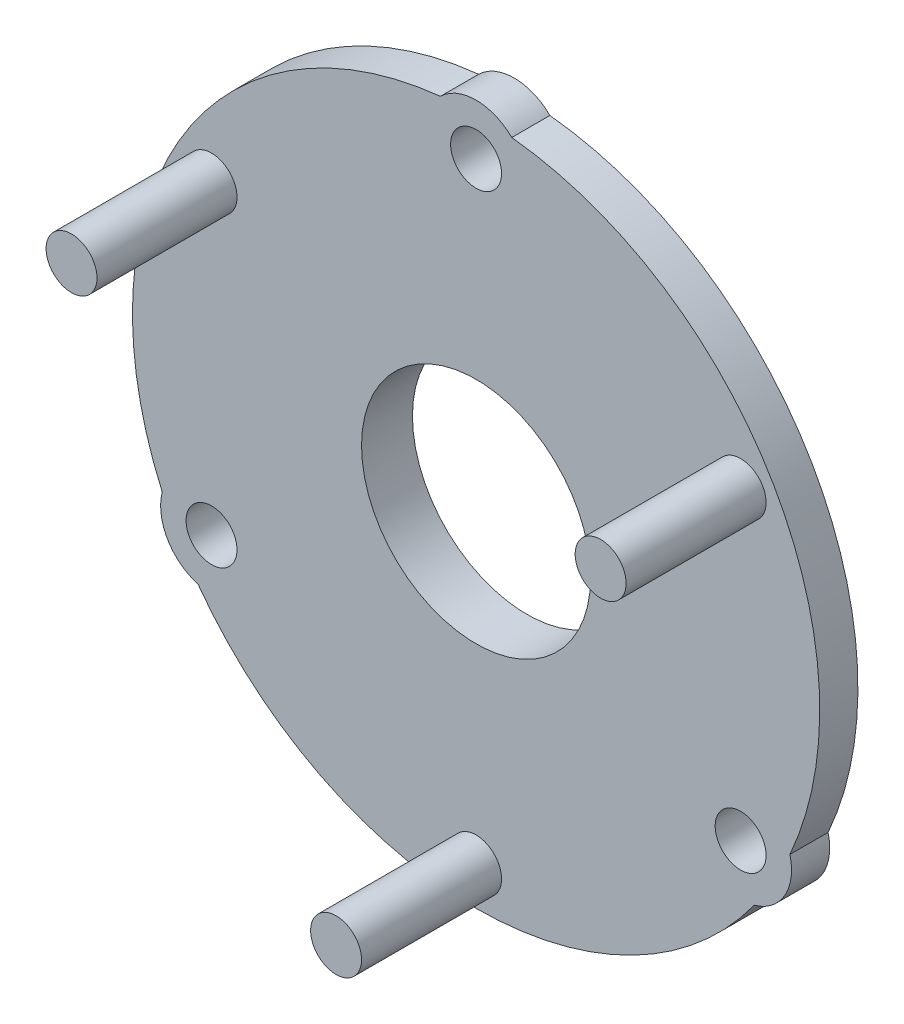
ISO-10303-21;
HEADER;
FILE_DESCRIPTION(('STEP AP214'),'2;1');
FILE_NAME('part.step','',(''),(''),'','','');
FILE_SCHEMA(('AUTOMOTIVE_DESIGN { 1 0 10303 214 1 1 1 1 }'));
ENDSEC;
DATA;
#1=APPLICATION_CONTEXT('core data for automotive mechanical design processes');
#2=APPLICATION_PROTOCOL_DEFINITION('international standard','automotive_design',2000,#1);
#3=PRODUCT_CONTEXT('',#1,'mechanical');
#4=PRODUCT('Part','Part','',(#3));
#5=PRODUCT_RELATED_PRODUCT_CATEGORY('part','',(#4));
#6=PRODUCT_DEFINITION_FORMATION('','',#4);
#7=PRODUCT_DEFINITION_CONTEXT('part definition',#1,'design');
#8=PRODUCT_DEFINITION('design','',#6,#7);
#9=PRODUCT_DEFINITION_SHAPE('','',#8);
#10=(LENGTH_UNIT() NAMED_UNIT(*) SI_UNIT(.MILLI.,.METRE.));
#11=(NAMED_UNIT(*) PLANE_ANGLE_UNIT() SI_UNIT($,.RADIAN.));
#12=(NAMED_UNIT(*) SI_UNIT($,.STERADIAN.) SOLID_ANGLE_UNIT());
#13=UNCERTAINTY_MEASURE_WITH_UNIT(LENGTH_MEASURE(1.E-05),#10,'distance_accuracy_value','');
#14=(GEOMETRIC_REPRESENTATION_CONTEXT(3) GLOBAL_UNCERTAINTY_ASSIGNED_CONTEXT((#13)) GLOBAL_UNIT_ASSIGNED_CONTEXT((#10,
#11,#12)) REPRESENTATION_CONTEXT('',''));
#15=CARTESIAN_POINT('',(0.,0.,0.));
#16=DIRECTION('',(0.,0.,1.));
#17=DIRECTION('',(1.,0.,0.));
#18=AXIS2_PLACEMENT_3D('',#15,#16,#17);
#19=CARTESIAN_POINT('',(5.19615242270662,-3.00000000000002,0.));
#20=DIRECTION('',(0.,0.,1.));
#21=DIRECTION('',(1.,0.,0.));
#22=AXIS2_PLACEMENT_3D('',#19,#20,#21);
#23=PLANE('',#22);
#24=CARTESIAN_POINT('',(0.,0.,0.));
#25=DIRECTION('',(0.,0.,1.));
#26=DIRECTION('',(1.,0.,0.));
#27=AXIS2_PLACEMENT_3D('',#24,#25,#26);
#28=CIRCLE('',#27,13.5);
#29=CARTESIAN_POINT('',(-10.9275824693891,-7.92703862578581,0.));
#30=VERTEX_POINT('',#29);
#31=CARTESIAN_POINT('',(10.927582469389,-7.92703862578597,0.));
#32=VERTEX_POINT('',#31);
#33=EDGE_CURVE('E89',#30,#32,#28,.T.);
#34=ORIENTED_EDGE('',*,*,#33,.F.);
#35=CARTESIAN_POINT('',(-10.3923048454133,-5.9999999999999,0.));
#36=DIRECTION('',(0.,0.,1.));
#37=DIRECTION('',(1.,0.,0.));
#38=AXIS2_PLACEMENT_3D('',#35,#36,#37);
#39=CIRCLE('',#38,1.99999999999999);
#40=CARTESIAN_POINT('',(-12.3288080614056,-5.50004470754732,0.));
#41=VERTEX_POINT('',#40);
#42=EDGE_CURVE('E116',#41,#30,#39,.T.);
#43=ORIENTED_EDGE('',*,*,#42,.F.);
#44=CARTESIAN_POINT('',(0.,0.,0.));
#45=DIRECTION('',(0.,0.,1.));
#46=DIRECTION('',(1.,0.,0.));
#47=AXIS2_PLACEMENT_3D('',#44,#45,#46);
#48=CIRCLE('',#47,13.5);
#49=CARTESIAN_POINT('',(-1.40122559201657,13.4270833333333,0.));
#50=VERTEX_POINT('',#49);
#51=EDGE_CURVE('E114',#50,#41,#48,.T.);
#52=ORIENTED_EDGE('',*,*,#51,.F.);
#53=CARTESIAN_POINT('',(0.,12.,0.));
#54=DIRECTION('',(0.,0.,1.));
#55=DIRECTION('',(1.,0.,0.));
#56=AXIS2_PLACEMENT_3D('',#53,#54,#55);
#57=CIRCLE('',#56,1.99999999999999);
#58=CARTESIAN_POINT('',(1.40122559201657,13.4270833333333,0.));
#59=VERTEX_POINT('',#58);
#60=EDGE_CURVE('E112',#59,#50,#57,.T.);
#61=ORIENTED_EDGE('',*,*,#60,.F.);
#62=CARTESIAN_POINT('',(0.,0.,0.));
#63=DIRECTION('',(0.,0.,1.));
#64=DIRECTION('',(1.,0.,0.));
#65=AXIS2_PLACEMENT_3D('',#62,#63,#64);
#66=CIRCLE('',#65,13.5);
#67=CARTESIAN_POINT('',(12.3288080614056,-5.50004470754747,0.));
#68=VERTEX_POINT('',#67);
#69=EDGE_CURVE('E91',#68,#59,#66,.T.);
#70=ORIENTED_EDGE('',*,*,#69,.F.);
#71=CARTESIAN_POINT('',(10.3923048454132,-6.00000000000005,0.));
#72=DIRECTION('',(0.,0.,1.));
#73=DIRECTION('',(1.,0.,0.));
#74=AXIS2_PLACEMENT_3D('',#71,#72,#73);
#75=CIRCLE('',#74,2.);
#76=EDGE_CURVE('E84',#32,#68,#75,.T.);
#77=ORIENTED_EDGE('',*,*,#76,.F.);
#78=EDGE_LOOP('',(#34,#43,#52,#61,#70,#77));
#79=FACE_BOUND('',#78,.T.);
#80=CARTESIAN_POINT('',(0.,12.,0.));
#81=DIRECTION('',(0.,0.,1.));
#82=DIRECTION('',(1.,0.,0.));
#83=AXIS2_PLACEMENT_3D('',#80,#81,#82);
#84=CIRCLE('',#83,1.);
#85=CARTESIAN_POINT('',(1.,12.,0.));
#86=VERTEX_POINT('',#85);
#87=EDGE_CURVE('E104',#86,#86,#84,.T.);
#88=ORIENTED_EDGE('',*,*,#87,.T.);
#89=EDGE_LOOP('',(#88));
#90=FACE_BOUND('',#89,.T.);
#91=CARTESIAN_POINT('',(10.3923048454132,-6.00000000000005,0.));
#92=DIRECTION('',(0.,0.,1.));
#93=DIRECTION('',(1.,0.,0.));
#94=AXIS2_PLACEMENT_3D('',#91,#92,#93);
#95=CIRCLE('',#94,1.);
#96=CARTESIAN_POINT('',(11.3923048454132,-6.00000000000005,0.));
#97=VERTEX_POINT('',#96);
#98=EDGE_CURVE('E255',#97,#97,#95,.T.);
#99=ORIENTED_EDGE('',*,*,#98,.T.);
#100=EDGE_LOOP('',(#99));
#101=FACE_BOUND('',#100,.T.);
#102=CARTESIAN_POINT('',(-10.3923048454133,-5.9999999999999,0.));
#103=DIRECTION('',(0.,0.,1.));
#104=DIRECTION('',(1.,0.,0.));
#105=AXIS2_PLACEMENT_3D('',#102,#103,#104);
#106=CIRCLE('',#105,1.);
#107=CARTESIAN_POINT('',(-9.39230484541332,-5.9999999999999,0.));
#108=VERTEX_POINT('',#107);
#109=EDGE_CURVE('E249',#108,#108,#106,.T.);
#110=ORIENTED_EDGE('',*,*,#109,.T.);
#111=EDGE_LOOP('',(#110));
#112=FACE_BOUND('',#111,.T.);
#113=CARTESIAN_POINT('',(0.,0.,0.));
#114=DIRECTION('',(0.,0.,1.));
#115=DIRECTION('',(1.,0.,0.));
#116=AXIS2_PLACEMENT_3D('',#113,#114,#115);
#117=CIRCLE('',#116,6.);
#118=CARTESIAN_POINT('',(6.,0.,0.));
#119=VERTEX_POINT('',#118);
#120=EDGE_CURVE('E11',#119,#119,#117,.F.);
#121=ORIENTED_EDGE('',*,*,#120,.F.);
#122=EDGE_LOOP('',(#121));
#123=FACE_BOUND('',#122,.T.);
#124=ADVANCED_FACE('F31',(#79,#90,#101,#112,#123),#23,.F.);
#125=CARTESIAN_POINT('',(5.19615242270662,-3.00000000000002,1.5));
#126=DIRECTION('',(0.,0.,1.));
#127=DIRECTION('',(1.,0.,0.));
#128=AXIS2_PLACEMENT_3D('',#125,#126,#127);
#129=PLANE('',#128);
#130=CARTESIAN_POINT('',(0.,0.,1.5));
#131=DIRECTION('',(0.,0.,1.));
#132=DIRECTION('',(1.,0.,0.));
#133=AXIS2_PLACEMENT_3D('',#130,#131,#132);
#134=CIRCLE('',#133,4.5);
#135=CARTESIAN_POINT('',(4.5,0.,1.5));
#136=VERTEX_POINT('',#135);
#137=EDGE_CURVE('E218',#136,#136,#134,.T.);
#138=ORIENTED_EDGE('',*,*,#137,.F.);
#139=EDGE_LOOP('',(#138));
#140=FACE_BOUND('',#139,.T.);
#141=CARTESIAN_POINT('',(0.,-12.,1.5));
#142=DIRECTION('',(0.,0.,1.));
#143=DIRECTION('',(1.,0.,0.));
#144=AXIS2_PLACEMENT_3D('',#141,#142,#143);
#145=CIRCLE('',#144,1.);
#146=CARTESIAN_POINT('',(0.999999999999962,-12.,1.5));
#147=VERTEX_POINT('',#146);
#148=EDGE_CURVE('E234',#147,#147,#145,.T.);
#149=ORIENTED_EDGE('',*,*,#148,.F.);
#150=EDGE_LOOP('',(#149));
#151=FACE_BOUND('',#150,.T.);
#152=CARTESIAN_POINT('',(0.,0.,1.5));
#153=DIRECTION('',(0.,0.,1.));
#154=DIRECTION('',(1.,0.,0.));
#155=AXIS2_PLACEMENT_3D('',#152,#153,#154);
#156=CIRCLE('',#155,13.5);
#157=CARTESIAN_POINT('',(-10.9275824693891,-7.92703862578581,1.5));
#158=VERTEX_POINT('',#157);
#159=CARTESIAN_POINT('',(10.927582469389,-7.92703862578597,1.5));
#160=VERTEX_POINT('',#159);
#161=EDGE_CURVE('E118',#158,#160,#156,.T.);
#162=ORIENTED_EDGE('',*,*,#161,.T.);
#163=CARTESIAN_POINT('',(10.3923048454132,-6.00000000000005,1.5));
#164=DIRECTION('',(0.,0.,1.));
#165=DIRECTION('',(1.,0.,0.));
#166=AXIS2_PLACEMENT_3D('',#163,#164,#165);
#167=CIRCLE('',#166,2.);
#168=CARTESIAN_POINT('',(12.3288080614056,-5.50004470754747,1.5));
#169=VERTEX_POINT('',#168);
#170=EDGE_CURVE('E98',#160,#169,#167,.T.);
#171=ORIENTED_EDGE('',*,*,#170,.T.);
#172=CARTESIAN_POINT('',(0.,0.,1.5));
#173=DIRECTION('',(0.,0.,1.));
#174=DIRECTION('',(1.,0.,0.));
#175=AXIS2_PLACEMENT_3D('',#172,#173,#174);
#176=CIRCLE('',#175,13.5);
#177=CARTESIAN_POINT('',(1.40122559201657,13.4270833333333,1.5));
#178=VERTEX_POINT('',#177);
#179=EDGE_CURVE('E121',#169,#178,#176,.T.);
#180=ORIENTED_EDGE('',*,*,#179,.T.);
#181=CARTESIAN_POINT('',(0.,12.,1.5));
#182=DIRECTION('',(0.,0.,1.));
#183=DIRECTION('',(1.,0.,0.));
#184=AXIS2_PLACEMENT_3D('',#181,#182,#183);
#185=CIRCLE('',#184,1.99999999999999);
#186=CARTESIAN_POINT('',(-1.40122559201657,13.4270833333333,1.5));
#187=VERTEX_POINT('',#186);
#188=EDGE_CURVE('E123',#178,#187,#185,.T.);
#189=ORIENTED_EDGE('',*,*,#188,.T.);
#190=CARTESIAN_POINT('',(0.,0.,1.5));
#191=DIRECTION('',(0.,0.,1.));
#192=DIRECTION('',(1.,0.,0.));
#193=AXIS2_PLACEMENT_3D('',#190,#191,#192);
#194=CIRCLE('',#193,13.5);
#195=CARTESIAN_POINT('',(-12.3288080614056,-5.50004470754732,1.5));
#196=VERTEX_POINT('',#195);
#197=EDGE_CURVE('E51',#187,#196,#194,.T.);
#198=ORIENTED_EDGE('',*,*,#197,.T.);
#199=CARTESIAN_POINT('',(-10.3923048454133,-5.9999999999999,1.5));
#200=DIRECTION('',(0.,0.,1.));
#201=DIRECTION('',(1.,0.,0.));
#202=AXIS2_PLACEMENT_3D('',#199,#200,#201);
#203=CIRCLE('',#202,1.99999999999999);
#204=EDGE_CURVE('E46',#196,#158,#203,.T.);
#205=ORIENTED_EDGE('',*,*,#204,.T.);
#206=EDGE_LOOP('',(#162,#171,#180,#189,#198,#205));
#207=FACE_BOUND('',#206,.T.);
#208=CARTESIAN_POINT('',(0.,12.,1.5));
#209=DIRECTION('',(0.,0.,1.));
#210=DIRECTION('',(1.,0.,0.));
#211=AXIS2_PLACEMENT_3D('',#208,#209,#210);
#212=CIRCLE('',#211,1.);
#213=CARTESIAN_POINT('',(1.,12.,1.5));
#214=VERTEX_POINT('',#213);
#215=EDGE_CURVE('E107',#214,#214,#212,.T.);
#216=ORIENTED_EDGE('',*,*,#215,.F.);
#217=EDGE_LOOP('',(#216));
#218=FACE_BOUND('',#217,.T.);
#219=CARTESIAN_POINT('',(10.3923048454132,-6.00000000000005,1.5));
#220=DIRECTION('',(0.,0.,1.));
#221=DIRECTION('',(1.,0.,0.));
#222=AXIS2_PLACEMENT_3D('',#219,#220,#221);
#223=CIRCLE('',#222,1.);
#224=CARTESIAN_POINT('',(11.3923048454132,-6.00000000000005,1.5));
#225=VERTEX_POINT('',#224);
#226=EDGE_CURVE('E252',#225,#225,#223,.T.);
#227=ORIENTED_EDGE('',*,*,#226,.F.);
#228=EDGE_LOOP('',(#227));
#229=FACE_BOUND('',#228,.T.);
#230=CARTESIAN_POINT('',(-10.3923048454133,-5.9999999999999,1.5));
#231=DIRECTION('',(0.,0.,1.));
#232=DIRECTION('',(1.,0.,0.));
#233=AXIS2_PLACEMENT_3D('',#230,#231,#232);
#234=CIRCLE('',#233,1.);
#235=CARTESIAN_POINT('',(-9.39230484541332,-5.9999999999999,1.5));
#236=VERTEX_POINT('',#235);
#237=EDGE_CURVE('E246',#236,#236,#234,.T.);
#238=ORIENTED_EDGE('',*,*,#237,.F.);
#239=EDGE_LOOP('',(#238));
#240=FACE_BOUND('',#239,.T.);
#241=CARTESIAN_POINT('',(10.3923048454133,6.00000000000002,1.5));
#242=DIRECTION('',(0.,0.,1.));
#243=DIRECTION('',(1.,0.,0.));
#244=AXIS2_PLACEMENT_3D('',#241,#242,#243);
#245=CIRCLE('',#244,1.);
#246=CARTESIAN_POINT('',(11.3923048454133,6.00000000000002,1.5));
#247=VERTEX_POINT('',#246);
#248=EDGE_CURVE('E240',#247,#247,#245,.T.);
#249=ORIENTED_EDGE('',*,*,#248,.F.);
#250=EDGE_LOOP('',(#249));
#251=FACE_BOUND('',#250,.T.);
#252=CARTESIAN_POINT('',(-10.3923048454132,6.00000000000008,1.5));
#253=DIRECTION('',(0.,0.,1.));
#254=DIRECTION('',(1.,0.,0.));
#255=AXIS2_PLACEMENT_3D('',#252,#253,#254);
#256=CIRCLE('',#255,1.);
#257=CARTESIAN_POINT('',(-9.39230484541322,6.00000000000008,1.5));
#258=VERTEX_POINT('',#257);
#259=EDGE_CURVE('E228',#258,#258,#256,.T.);
#260=ORIENTED_EDGE('',*,*,#259,.F.);
#261=EDGE_LOOP('',(#260));
#262=FACE_BOUND('',#261,.T.);
#263=ADVANCED_FACE('F142',(#140,#151,#207,#218,#229,#240,#251,#262),#129,.T.);
#264=CARTESIAN_POINT('',(0.,0.,1.5));
#265=DIRECTION('',(0.,0.,-1.));
#266=DIRECTION('',(-1.,0.,0.));
#267=AXIS2_PLACEMENT_3D('',#264,#265,#266);
#268=CYLINDRICAL_SURFACE('',#267,13.5);
#269=ORIENTED_EDGE('',*,*,#33,.T.);
#270=DIRECTION('',(0.,0.,-1.));
#271=VECTOR('',#270,1.);
#272=CARTESIAN_POINT('',(10.927582469389,-7.92703862578597,1.5));
#273=LINE('',#272,#271);
#274=EDGE_CURVE('E39',#160,#32,#273,.T.);
#275=ORIENTED_EDGE('',*,*,#274,.F.);
#276=ORIENTED_EDGE('',*,*,#161,.F.);
#277=DIRECTION('',(0.,0.,-1.));
#278=VECTOR('',#277,1.);
#279=CARTESIAN_POINT('',(-10.9275824693891,-7.92703862578581,1.5));
#280=LINE('',#279,#278);
#281=EDGE_CURVE('E103',#158,#30,#280,.T.);
#282=ORIENTED_EDGE('',*,*,#281,.T.);
#283=EDGE_LOOP('',(#269,#275,#276,#282));
#284=FACE_BOUND('',#283,.T.);
#285=ADVANCED_FACE('F33',(#284),#268,.T.);
#286=CARTESIAN_POINT('',(10.3923048454132,-6.00000000000005,1.5));
#287=DIRECTION('',(0.,0.,-1.));
#288=DIRECTION('',(-1.,0.,0.));
#289=AXIS2_PLACEMENT_3D('',#286,#287,#288);
#290=CYLINDRICAL_SURFACE('',#289,2.);
#291=ORIENTED_EDGE('',*,*,#76,.T.);
#292=DIRECTION('',(0.,0.,-1.));
#293=VECTOR('',#292,1.);
#294=CARTESIAN_POINT('',(12.3288080614056,-5.50004470754747,1.5));
#295=LINE('',#294,#293);
#296=EDGE_CURVE('E101',#169,#68,#295,.T.);
#297=ORIENTED_EDGE('',*,*,#296,.F.);
#298=ORIENTED_EDGE('',*,*,#170,.F.);
#299=ORIENTED_EDGE('',*,*,#274,.T.);
#300=EDGE_LOOP('',(#291,#297,#298,#299));
#301=FACE_BOUND('',#300,.T.);
#302=ADVANCED_FACE('F97',(#301),#290,.T.);
#303=CARTESIAN_POINT('',(0.,0.,1.5));
#304=DIRECTION('',(0.,0.,-1.));
#305=DIRECTION('',(-1.,0.,0.));
#306=AXIS2_PLACEMENT_3D('',#303,#304,#305);
#307=CYLINDRICAL_SURFACE('',#306,13.5);
#308=ORIENTED_EDGE('',*,*,#69,.T.);
#309=DIRECTION('',(0.,0.,-1.));
#310=VECTOR('',#309,1.);
#311=CARTESIAN_POINT('',(1.40122559201657,13.4270833333333,1.5));
#312=LINE('',#311,#310);
#313=EDGE_CURVE('E134',#178,#59,#312,.T.);
#314=ORIENTED_EDGE('',*,*,#313,.F.);
#315=ORIENTED_EDGE('',*,*,#179,.F.);
#316=ORIENTED_EDGE('',*,*,#296,.T.);
#317=EDGE_LOOP('',(#308,#314,#315,#316));
#318=FACE_BOUND('',#317,.T.);
#319=ADVANCED_FACE('F139',(#318),#307,.T.);
#320=CARTESIAN_POINT('',(0.,12.,1.5));
#321=DIRECTION('',(0.,0.,-1.));
#322=DIRECTION('',(-1.,0.,0.));
#323=AXIS2_PLACEMENT_3D('',#320,#321,#322);
#324=CYLINDRICAL_SURFACE('',#323,1.99999999999999);
#325=ORIENTED_EDGE('',*,*,#60,.T.);
#326=DIRECTION('',(0.,0.,-1.));
#327=VECTOR('',#326,1.);
#328=CARTESIAN_POINT('',(-1.40122559201657,13.4270833333333,1.5));
#329=LINE('',#328,#327);
#330=EDGE_CURVE('E131',#187,#50,#329,.T.);
#331=ORIENTED_EDGE('',*,*,#330,.F.);
#332=ORIENTED_EDGE('',*,*,#188,.F.);
#333=ORIENTED_EDGE('',*,*,#313,.T.);
#334=EDGE_LOOP('',(#325,#331,#332,#333));
#335=FACE_BOUND('',#334,.T.);
#336=ADVANCED_FACE('F146',(#335),#324,.T.);
#337=CARTESIAN_POINT('',(0.,0.,1.5));
#338=DIRECTION('',(0.,0.,-1.));
#339=DIRECTION('',(-1.,0.,0.));
#340=AXIS2_PLACEMENT_3D('',#337,#338,#339);
#341=CYLINDRICAL_SURFACE('',#340,13.5);
#342=ORIENTED_EDGE('',*,*,#51,.T.);
#343=DIRECTION('',(0.,0.,-1.));
#344=VECTOR('',#343,1.);
#345=CARTESIAN_POINT('',(-12.3288080614056,-5.50004470754732,1.5));
#346=LINE('',#345,#344);
#347=EDGE_CURVE('E128',#196,#41,#346,.T.);
#348=ORIENTED_EDGE('',*,*,#347,.F.);
#349=ORIENTED_EDGE('',*,*,#197,.F.);
#350=ORIENTED_EDGE('',*,*,#330,.T.);
#351=EDGE_LOOP('',(#342,#348,#349,#350));
#352=FACE_BOUND('',#351,.T.);
#353=ADVANCED_FACE('F149',(#352),#341,.T.);
#354=CARTESIAN_POINT('',(-10.3923048454133,-5.9999999999999,1.5));
#355=DIRECTION('',(0.,0.,-1.));
#356=DIRECTION('',(-1.,0.,0.));
#357=AXIS2_PLACEMENT_3D('',#354,#355,#356);
#358=CYLINDRICAL_SURFACE('',#357,1.99999999999999);
#359=ORIENTED_EDGE('',*,*,#42,.T.);
#360=ORIENTED_EDGE('',*,*,#281,.F.);
#361=ORIENTED_EDGE('',*,*,#204,.F.);
#362=ORIENTED_EDGE('',*,*,#347,.T.);
#363=EDGE_LOOP('',(#359,#360,#361,#362));
#364=FACE_BOUND('',#363,.T.);
#365=ADVANCED_FACE('F151',(#364),#358,.T.);
#366=CARTESIAN_POINT('',(0.,12.,0.));
#367=DIRECTION('',(0.,0.,1.));
#368=DIRECTION('',(1.,0.,0.));
#369=AXIS2_PLACEMENT_3D('',#366,#367,#368);
#370=CYLINDRICAL_SURFACE('',#369,1.);
#371=ORIENTED_EDGE('',*,*,#87,.F.);
#372=EDGE_LOOP('',(#371));
#373=FACE_BOUND('',#372,.T.);
#374=ORIENTED_EDGE('',*,*,#215,.T.);
#375=EDGE_LOOP('',(#374));
#376=FACE_BOUND('',#375,.T.);
#377=ADVANCED_FACE('F153',(#373,#376),#370,.F.);
#378=CARTESIAN_POINT('',(10.3923048454132,-6.00000000000005,0.));
#379=DIRECTION('',(0.,0.,1.));
#380=DIRECTION('',(1.,0.,0.));
#381=AXIS2_PLACEMENT_3D('',#378,#379,#380);
#382=CYLINDRICAL_SURFACE('',#381,1.);
#383=ORIENTED_EDGE('',*,*,#98,.F.);
#384=EDGE_LOOP('',(#383));
#385=FACE_BOUND('',#384,.T.);
#386=ORIENTED_EDGE('',*,*,#226,.T.);
#387=EDGE_LOOP('',(#386));
#388=FACE_BOUND('',#387,.T.);
#389=ADVANCED_FACE('F159',(#385,#388),#382,.F.);
#390=CARTESIAN_POINT('',(-10.3923048454133,-5.9999999999999,0.));
#391=DIRECTION('',(0.,0.,1.));
#392=DIRECTION('',(1.,0.,0.));
#393=AXIS2_PLACEMENT_3D('',#390,#391,#392);
#394=CYLINDRICAL_SURFACE('',#393,1.);
#395=ORIENTED_EDGE('',*,*,#109,.F.);
#396=EDGE_LOOP('',(#395));
#397=FACE_BOUND('',#396,.T.);
#398=ORIENTED_EDGE('',*,*,#237,.T.);
#399=EDGE_LOOP('',(#398));
#400=FACE_BOUND('',#399,.T.);
#401=ADVANCED_FACE('F173',(#397,#400),#394,.F.);
#402=CARTESIAN_POINT('',(10.3923048454133,6.00000000000002,7.));
#403=DIRECTION('',(0.,0.,-1.));
#404=DIRECTION('',(-1.,0.,0.));
#405=AXIS2_PLACEMENT_3D('',#402,#403,#404);
#406=CYLINDRICAL_SURFACE('',#405,1.);
#407=CARTESIAN_POINT('',(10.3923048454133,6.00000000000002,7.));
#408=DIRECTION('',(0.,0.,1.));
#409=DIRECTION('',(1.,0.,0.));
#410=AXIS2_PLACEMENT_3D('',#407,#408,#409);
#411=CIRCLE('',#410,1.);
#412=CARTESIAN_POINT('',(11.3923048454133,6.00000000000002,7.));
#413=VERTEX_POINT('',#412);
#414=EDGE_CURVE('E243',#413,#413,#411,.T.);
#415=ORIENTED_EDGE('',*,*,#414,.F.);
#416=EDGE_LOOP('',(#415));
#417=FACE_BOUND('',#416,.T.);
#418=ORIENTED_EDGE('',*,*,#248,.T.);
#419=EDGE_LOOP('',(#418));
#420=FACE_BOUND('',#419,.T.);
#421=ADVANCED_FACE('F177',(#417,#420),#406,.T.);
#422=CARTESIAN_POINT('',(10.3923048454133,6.00000000000002,7.));
#423=DIRECTION('',(0.,0.,1.));
#424=DIRECTION('',(1.,0.,0.));
#425=AXIS2_PLACEMENT_3D('',#422,#423,#424);
#426=PLANE('',#425);
#427=ORIENTED_EDGE('',*,*,#414,.T.);
#428=EDGE_LOOP('',(#427));
#429=FACE_BOUND('',#428,.T.);
#430=ADVANCED_FACE('F181',(#429),#426,.T.);
#431=CARTESIAN_POINT('',(0.,-12.,7.));
#432=DIRECTION('',(0.,0.,-1.));
#433=DIRECTION('',(-1.,0.,0.));
#434=AXIS2_PLACEMENT_3D('',#431,#432,#433);
#435=CYLINDRICAL_SURFACE('',#434,1.);
#436=CARTESIAN_POINT('',(0.,-12.,7.));
#437=DIRECTION('',(0.,0.,1.));
#438=DIRECTION('',(1.,0.,0.));
#439=AXIS2_PLACEMENT_3D('',#436,#437,#438);
#440=CIRCLE('',#439,1.);
#441=CARTESIAN_POINT('',(0.999999999999962,-12.,7.));
#442=VERTEX_POINT('',#441);
#443=EDGE_CURVE('E237',#442,#442,#440,.T.);
#444=ORIENTED_EDGE('',*,*,#443,.F.);
#445=EDGE_LOOP('',(#444));
#446=FACE_BOUND('',#445,.T.);
#447=ORIENTED_EDGE('',*,*,#148,.T.);
#448=EDGE_LOOP('',(#447));
#449=FACE_BOUND('',#448,.T.);
#450=ADVANCED_FACE('F185',(#446,#449),#435,.T.);
#451=CARTESIAN_POINT('',(0.,-12.,7.));
#452=DIRECTION('',(0.,0.,1.));
#453=DIRECTION('',(1.,0.,0.));
#454=AXIS2_PLACEMENT_3D('',#451,#452,#453);
#455=PLANE('',#454);
#456=ORIENTED_EDGE('',*,*,#443,.T.);
#457=EDGE_LOOP('',(#456));
#458=FACE_BOUND('',#457,.T.);
#459=ADVANCED_FACE('F189',(#458),#455,.T.);
#460=CARTESIAN_POINT('',(-10.3923048454132,6.00000000000008,7.));
#461=DIRECTION('',(0.,0.,-1.));
#462=DIRECTION('',(-1.,0.,0.));
#463=AXIS2_PLACEMENT_3D('',#460,#461,#462);
#464=CYLINDRICAL_SURFACE('',#463,1.);
#465=CARTESIAN_POINT('',(-10.3923048454132,6.00000000000008,7.));
#466=DIRECTION('',(0.,0.,1.));
#467=DIRECTION('',(1.,0.,0.));
#468=AXIS2_PLACEMENT_3D('',#465,#466,#467);
#469=CIRCLE('',#468,1.);
#470=CARTESIAN_POINT('',(-9.39230484541322,6.00000000000008,7.));
#471=VERTEX_POINT('',#470);
#472=EDGE_CURVE('E231',#471,#471,#469,.T.);
#473=ORIENTED_EDGE('',*,*,#472,.F.);
#474=EDGE_LOOP('',(#473));
#475=FACE_BOUND('',#474,.T.);
#476=ORIENTED_EDGE('',*,*,#259,.T.);
#477=EDGE_LOOP('',(#476));
#478=FACE_BOUND('',#477,.T.);
#479=ADVANCED_FACE('F193',(#475,#478),#464,.T.);
#480=CARTESIAN_POINT('',(-10.3923048454132,6.00000000000008,7.));
#481=DIRECTION('',(0.,0.,1.));
#482=DIRECTION('',(1.,0.,0.));
#483=AXIS2_PLACEMENT_3D('',#480,#481,#482);
#484=PLANE('',#483);
#485=ORIENTED_EDGE('',*,*,#472,.T.);
#486=EDGE_LOOP('',(#485));
#487=FACE_BOUND('',#486,.T.);
#488=ADVANCED_FACE('F197',(#487),#484,.T.);
#489=CARTESIAN_POINT('',(0.,0.,-0.5));
#490=DIRECTION('',(0.,0.,1.));
#491=DIRECTION('',(1.,0.,0.));
#492=AXIS2_PLACEMENT_3D('',#489,#490,#491);
#493=CYLINDRICAL_SURFACE('',#492,6.);
#494=CARTESIAN_POINT('',(0.,0.,-0.5));
#495=DIRECTION('',(0.,0.,-1.));
#496=DIRECTION('',(-1.,0.,0.));
#497=AXIS2_PLACEMENT_3D('',#494,#495,#496);
#498=CIRCLE('',#497,6.);
#499=CARTESIAN_POINT('',(-6.,0.,-0.5));
#500=VERTEX_POINT('',#499);
#501=EDGE_CURVE('E223',#500,#500,#498,.T.);
#502=ORIENTED_EDGE('',*,*,#501,.F.);
#503=EDGE_LOOP('',(#502));
#504=FACE_BOUND('',#503,.T.);
#505=ORIENTED_EDGE('',*,*,#120,.T.);
#506=EDGE_LOOP('',(#505));
#507=FACE_BOUND('',#506,.T.);
#508=ADVANCED_FACE('F201',(#504,#507),#493,.T.);
#509=CARTESIAN_POINT('',(0.,0.,-0.5));
#510=DIRECTION('',(0.,0.,-1.));
#511=DIRECTION('',(-1.,0.,0.));
#512=AXIS2_PLACEMENT_3D('',#509,#510,#511);
#513=PLANE('',#512);
#514=CARTESIAN_POINT('',(0.,0.,-0.5));
#515=DIRECTION('',(0.,0.,-1.));
#516=DIRECTION('',(-1.,0.,0.));
#517=AXIS2_PLACEMENT_3D('',#514,#515,#516);
#518=CIRCLE('',#517,4.5);
#519=CARTESIAN_POINT('',(-4.5,0.,-0.5));
#520=VERTEX_POINT('',#519);
#521=EDGE_CURVE('E221',#520,#520,#518,.T.);
#522=ORIENTED_EDGE('',*,*,#521,.F.);
#523=EDGE_LOOP('',(#522));
#524=FACE_BOUND('',#523,.T.);
#525=ORIENTED_EDGE('',*,*,#501,.T.);
#526=EDGE_LOOP('',(#525));
#527=FACE_BOUND('',#526,.T.);
#528=ADVANCED_FACE('F205',(#524,#527),#513,.T.);
#529=CARTESIAN_POINT('',(0.,0.,7.));
#530=DIRECTION('',(0.,0.,-1.));
#531=DIRECTION('',(-1.,0.,0.));
#532=AXIS2_PLACEMENT_3D('',#529,#530,#531);
#533=CYLINDRICAL_SURFACE('',#532,4.5);
#534=ORIENTED_EDGE('',*,*,#137,.T.);
#535=EDGE_LOOP('',(#534));
#536=FACE_BOUND('',#535,.T.);
#537=ORIENTED_EDGE('',*,*,#521,.T.);
#538=EDGE_LOOP('',(#537));
#539=FACE_BOUND('',#538,.T.);
#540=ADVANCED_FACE('F209',(#536,#539),#533,.F.);
#541=CLOSED_SHELL('',(#124,#263,#285,#302,#319,#336,#353,#365,#377,#389,#401,#421,#430,#450,
#459,#479,#488,#508,#528,#540));
#542=MANIFOLD_SOLID_BREP('B2',#541);
#543=ADVANCED_BREP_SHAPE_REPRESENTATION('',(#18,#542),#14);
#544=SHAPE_DEFINITION_REPRESENTATION(#9,#543);
ENDSEC;
END-ISO-10303-21;
